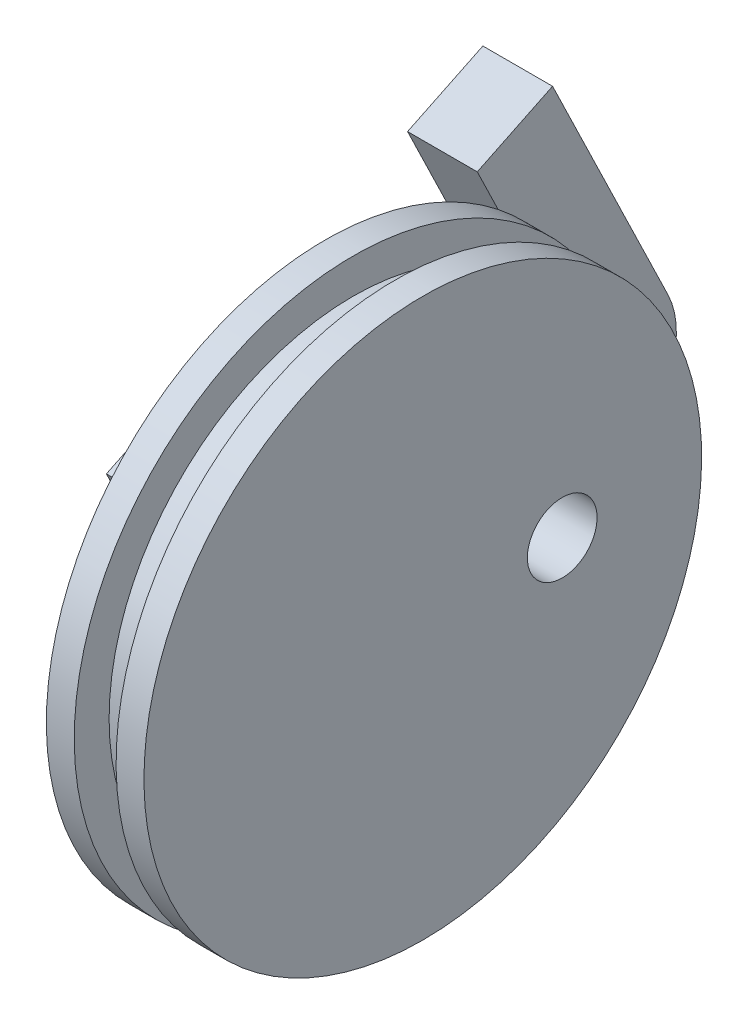
ISO-10303-21;
HEADER;
FILE_DESCRIPTION(('STEP AP214'),'2;1');
FILE_NAME('part.step','',(''),(''),'','','');
FILE_SCHEMA(('AUTOMOTIVE_DESIGN { 1 0 10303 214 1 1 1 1 }'));
ENDSEC;
DATA;
#1=APPLICATION_CONTEXT('core data for automotive mechanical design processes');
#2=APPLICATION_PROTOCOL_DEFINITION('international standard','automotive_design',2000,#1);
#3=PRODUCT_CONTEXT('',#1,'mechanical');
#4=PRODUCT('Part','Part','',(#3));
#5=PRODUCT_RELATED_PRODUCT_CATEGORY('part','',(#4));
#6=PRODUCT_DEFINITION_FORMATION('','',#4);
#7=PRODUCT_DEFINITION_CONTEXT('part definition',#1,'design');
#8=PRODUCT_DEFINITION('design','',#6,#7);
#9=PRODUCT_DEFINITION_SHAPE('','',#8);
#10=(LENGTH_UNIT() NAMED_UNIT(*) SI_UNIT(.MILLI.,.METRE.));
#11=(NAMED_UNIT(*) PLANE_ANGLE_UNIT() SI_UNIT($,.RADIAN.));
#12=(NAMED_UNIT(*) SI_UNIT($,.STERADIAN.) SOLID_ANGLE_UNIT());
#13=UNCERTAINTY_MEASURE_WITH_UNIT(LENGTH_MEASURE(1.E-05),#10,'distance_accuracy_value','');
#14=(GEOMETRIC_REPRESENTATION_CONTEXT(3) GLOBAL_UNCERTAINTY_ASSIGNED_CONTEXT((#13)) GLOBAL_UNIT_ASSIGNED_CONTEXT((#10,
#11,#12)) REPRESENTATION_CONTEXT('',''));
#15=CARTESIAN_POINT('',(0.,0.,0.));
#16=DIRECTION('',(0.,0.,1.));
#17=DIRECTION('',(1.,0.,0.));
#18=AXIS2_PLACEMENT_3D('',#15,#16,#17);
#19=CARTESIAN_POINT('',(-3.5,0.,0.));
#20=DIRECTION('',(-1.,0.,0.));
#21=DIRECTION('',(0.,-1.,0.));
#22=AXIS2_PLACEMENT_3D('',#19,#20,#21);
#23=CYLINDRICAL_SURFACE('',#22,20.);
#24=CARTESIAN_POINT('',(3.5,0.,0.));
#25=DIRECTION('',(-1.,0.,0.));
#26=DIRECTION('',(0.,-1.,0.));
#27=AXIS2_PLACEMENT_3D('',#24,#25,#26);
#28=CIRCLE('',#27,20.);
#29=CARTESIAN_POINT('',(3.50000000000001,-20.,0.));
#30=VERTEX_POINT('',#29);
#31=EDGE_CURVE('E162',#30,#30,#28,.T.);
#32=ORIENTED_EDGE('',*,*,#31,.T.);
#33=EDGE_LOOP('',(#32));
#34=FACE_BOUND('',#33,.T.);
#35=CARTESIAN_POINT('',(1.50000000000001,0.,0.));
#36=DIRECTION('',(-1.,0.,0.));
#37=DIRECTION('',(0.,-1.,0.));
#38=AXIS2_PLACEMENT_3D('',#35,#36,#37);
#39=CIRCLE('',#38,20.);
#40=CARTESIAN_POINT('',(1.50000000000001,-20.,0.));
#41=VERTEX_POINT('',#40);
#42=EDGE_CURVE('E49',#41,#41,#39,.T.);
#43=ORIENTED_EDGE('',*,*,#42,.F.);
#44=EDGE_LOOP('',(#43));
#45=FACE_BOUND('',#44,.T.);
#46=ADVANCED_FACE('F45',(#34,#45),#23,.T.);
#47=CARTESIAN_POINT('',(1.50000000000001,0.,0.));
#48=DIRECTION('',(1.,0.,0.));
#49=DIRECTION('',(0.,1.,0.));
#50=AXIS2_PLACEMENT_3D('',#47,#48,#49);
#51=PLANE('',#50);
#52=CARTESIAN_POINT('',(1.50000000000001,0.,0.));
#53=DIRECTION('',(-1.,0.,0.));
#54=DIRECTION('',(0.,-1.,0.));
#55=AXIS2_PLACEMENT_3D('',#52,#53,#54);
#56=CIRCLE('',#55,17.5);
#57=CARTESIAN_POINT('',(1.50000000000001,-17.5,0.));
#58=VERTEX_POINT('',#57);
#59=EDGE_CURVE('E184',#58,#58,#56,.T.);
#60=ORIENTED_EDGE('',*,*,#59,.F.);
#61=EDGE_LOOP('',(#60));
#62=FACE_BOUND('',#61,.T.);
#63=ORIENTED_EDGE('',*,*,#42,.T.);
#64=EDGE_LOOP('',(#63));
#65=FACE_BOUND('',#64,.T.);
#66=ADVANCED_FACE('F47',(#62,#65),#51,.F.);
#67=CARTESIAN_POINT('',(-3.5,0.,0.));
#68=DIRECTION('',(-1.,0.,0.));
#69=DIRECTION('',(0.,-1.,0.));
#70=AXIS2_PLACEMENT_3D('',#67,#68,#69);
#71=CYLINDRICAL_SURFACE('',#70,17.5);
#72=ORIENTED_EDGE('',*,*,#59,.T.);
#73=EDGE_LOOP('',(#72));
#74=FACE_BOUND('',#73,.T.);
#75=CARTESIAN_POINT('',(-1.49999999999999,0.,0.));
#76=DIRECTION('',(-1.,0.,0.));
#77=DIRECTION('',(0.,-1.,0.));
#78=AXIS2_PLACEMENT_3D('',#75,#76,#77);
#79=CIRCLE('',#78,17.5);
#80=CARTESIAN_POINT('',(-1.49999999999999,-17.5,0.));
#81=VERTEX_POINT('',#80);
#82=EDGE_CURVE('E181',#81,#81,#79,.T.);
#83=ORIENTED_EDGE('',*,*,#82,.F.);
#84=EDGE_LOOP('',(#83));
#85=FACE_BOUND('',#84,.T.);
#86=ADVANCED_FACE('F277',(#74,#85),#71,.T.);
#87=CARTESIAN_POINT('',(-1.49999999999999,0.,0.));
#88=DIRECTION('',(1.,0.,0.));
#89=DIRECTION('',(0.,1.,0.));
#90=AXIS2_PLACEMENT_3D('',#87,#88,#89);
#91=PLANE('',#90);
#92=ORIENTED_EDGE('',*,*,#82,.T.);
#93=EDGE_LOOP('',(#92));
#94=FACE_BOUND('',#93,.T.);
#95=CARTESIAN_POINT('',(-1.49999999999999,0.,0.));
#96=DIRECTION('',(-1.,0.,0.));
#97=DIRECTION('',(0.,-1.,0.));
#98=AXIS2_PLACEMENT_3D('',#95,#96,#97);
#99=CIRCLE('',#98,20.);
#100=CARTESIAN_POINT('',(-1.49999999999999,-20.,0.));
#101=VERTEX_POINT('',#100);
#102=EDGE_CURVE('E177',#101,#101,#99,.T.);
#103=ORIENTED_EDGE('',*,*,#102,.F.);
#104=EDGE_LOOP('',(#103));
#105=FACE_BOUND('',#104,.T.);
#106=ADVANCED_FACE('F284',(#94,#105),#91,.T.);
#107=ORIENTED_EDGE('',*,*,#102,.T.);
#108=EDGE_LOOP('',(#107));
#109=FACE_BOUND('',#108,.T.);
#110=CARTESIAN_POINT('',(-3.49999999999999,0.,0.));
#111=DIRECTION('',(-1.,0.,0.));
#112=DIRECTION('',(0.,-1.,0.));
#113=AXIS2_PLACEMENT_3D('',#110,#111,#112);
#114=CIRCLE('',#113,20.);
#115=CARTESIAN_POINT('',(-3.5,15.6920361967464,-12.4));
#116=VERTEX_POINT('',#115);
#117=CARTESIAN_POINT('',(-3.49999999999999,-4.89593960126535,-19.3914871895056));
#118=VERTEX_POINT('',#117);
#119=EDGE_CURVE('E173',#116,#118,#114,.T.);
#120=ORIENTED_EDGE('',*,*,#119,.F.);
#121=EDGE_CURVE('E167',#118,#116,#114,.T.);
#122=ORIENTED_EDGE('',*,*,#121,.F.);
#123=EDGE_LOOP('',(#120,#122));
#124=FACE_BOUND('',#123,.T.);
#125=ADVANCED_FACE('F273',(#109,#124),#23,.T.);
#126=CARTESIAN_POINT('',(-3.5,0.,0.));
#127=DIRECTION('',(-1.,0.,0.));
#128=DIRECTION('',(0.,-1.,0.));
#129=AXIS2_PLACEMENT_3D('',#126,#127,#128);
#130=PLANE('',#129);
#131=DIRECTION('',(0.,-0.435889894354067,0.900000000000001));
#132=VECTOR('',#131,1.);
#133=CARTESIAN_POINT('',(-3.5,-6.1730090491866,-2.98972473588516));
#134=LINE('',#133,#132);
#135=CARTESIAN_POINT('',(-3.5,1.6730090491866,-19.1897247358852));
#136=VERTEX_POINT('',#135);
#137=CARTESIAN_POINT('',(-3.5,-2.25,-11.0897247358852));
#138=VERTEX_POINT('',#137);
#139=EDGE_CURVE('E201',#136,#138,#134,.T.);
#140=ORIENTED_EDGE('',*,*,#139,.T.);
#141=CARTESIAN_POINT('',(-3.5,0.,-10.));
#142=DIRECTION('',(-1.,0.,0.));
#143=DIRECTION('',(0.,-1.,0.));
#144=AXIS2_PLACEMENT_3D('',#141,#142,#143);
#145=CIRCLE('',#144,2.5);
#146=EDGE_CURVE('E62',#138,#138,#145,.T.);
#147=ORIENTED_EDGE('',*,*,#146,.F.);
#148=CARTESIAN_POINT('',(-3.5,-6.1730090491866,-2.98972473588516));
#149=VERTEX_POINT('',#148);
#150=EDGE_CURVE('E208',#138,#149,#134,.T.);
#151=ORIENTED_EDGE('',*,*,#150,.T.);
#152=DIRECTION('',(0.,-0.9,-0.435889894354066));
#153=VECTOR('',#152,1.);
#154=CARTESIAN_POINT('',(-3.5,0.,0.));
#155=LINE('',#154,#153);
#156=CARTESIAN_POINT('',(-3.5,10.9269909508134,5.2921832568421));
#157=VERTEX_POINT('',#156);
#158=EDGE_CURVE('E211',#157,#149,#155,.T.);
#159=ORIENTED_EDGE('',*,*,#158,.F.);
#160=DIRECTION('',(0.,-0.435889894354067,0.9));
#161=VECTOR('',#160,1.);
#162=CARTESIAN_POINT('',(-3.5,10.9269909508134,5.2921832568421));
#163=LINE('',#162,#161);
#164=CARTESIAN_POINT('',(-3.5,8.311651584689,10.6921832568421));
#165=VERTEX_POINT('',#164);
#166=EDGE_CURVE('E216',#157,#165,#163,.T.);
#167=ORIENTED_EDGE('',*,*,#166,.T.);
#168=DIRECTION('',(0.,-0.9,-0.435889894354067));
#169=VECTOR('',#168,1.);
#170=CARTESIAN_POINT('',(-3.5,-2.6153393661244,5.4));
#171=LINE('',#170,#169);
#172=CARTESIAN_POINT('',(-3.49999999999999,-8.78834841531096,2.41027526411486));
#173=VERTEX_POINT('',#172);
#174=EDGE_CURVE('E219',#165,#173,#171,.T.);
#175=ORIENTED_EDGE('',*,*,#174,.T.);
#176=CARTESIAN_POINT('',(-3.5,-6.1730090491866,-2.98972473588516));
#177=DIRECTION('',(-1.,0.,0.));
#178=DIRECTION('',(0.,-1.,0.));
#179=AXIS2_PLACEMENT_3D('',#176,#177,#178);
#180=CIRCLE('',#179,6.);
#181=CARTESIAN_POINT('',(-3.49999999999999,-11.5730090491866,-5.6050641020096));
#182=VERTEX_POINT('',#181);
#183=EDGE_CURVE('E222',#182,#173,#180,.T.);
#184=ORIENTED_EDGE('',*,*,#183,.F.);
#185=DIRECTION('',(0.,-0.435889894354067,0.9));
#186=VECTOR('',#185,1.);
#187=CARTESIAN_POINT('',(-3.49999999999999,-11.5730090491866,-5.60506410200956));
#188=LINE('',#187,#186);
#189=EDGE_CURVE('E11',#118,#182,#188,.T.);
#190=ORIENTED_EDGE('',*,*,#189,.F.);
#191=ORIENTED_EDGE('',*,*,#121,.T.);
#192=DIRECTION('',(0.,-0.900000000000001,-0.435889894354066));
#193=VECTOR('',#192,1.);
#194=CARTESIAN_POINT('',(-3.5,7.8460180983732,-16.2));
#195=LINE('',#194,#193);
#196=EDGE_CURVE('E55',#116,#136,#195,.T.);
#197=ORIENTED_EDGE('',*,*,#196,.T.);
#198=EDGE_LOOP('',(#140,#147,#151,#159,#167,#175,#184,#190,#191,#197));
#199=FACE_BOUND('',#198,.T.);
#200=ADVANCED_FACE('F283',(#199),#130,.T.);
#201=CARTESIAN_POINT('',(3.5,0.,0.));
#202=DIRECTION('',(-1.,0.,0.));
#203=DIRECTION('',(0.,-1.,0.));
#204=AXIS2_PLACEMENT_3D('',#201,#202,#203);
#205=PLANE('',#204);
#206=CARTESIAN_POINT('',(3.50000000000001,0.,-10.));
#207=DIRECTION('',(-1.,0.,0.));
#208=DIRECTION('',(0.,-1.,0.));
#209=AXIS2_PLACEMENT_3D('',#206,#207,#208);
#210=CIRCLE('',#209,2.5);
#211=CARTESIAN_POINT('',(3.50000000000001,-2.5,-10.));
#212=VERTEX_POINT('',#211);
#213=EDGE_CURVE('E226',#212,#212,#210,.T.);
#214=ORIENTED_EDGE('',*,*,#213,.T.);
#215=EDGE_LOOP('',(#214));
#216=FACE_BOUND('',#215,.T.);
#217=ORIENTED_EDGE('',*,*,#31,.F.);
#218=EDGE_LOOP('',(#217));
#219=FACE_BOUND('',#218,.T.);
#220=ADVANCED_FACE('F259',(#216,#219),#205,.F.);
#221=CARTESIAN_POINT('',(-3.5,0.,0.));
#222=DIRECTION('',(-1.,0.,0.));
#223=DIRECTION('',(0.,-1.,0.));
#224=AXIS2_PLACEMENT_3D('',#221,#222,#223);
#225=PLANE('',#224);
#226=CARTESIAN_POINT('',(-3.5,18.7730090491866,-10.9078167431579));
#227=VERTEX_POINT('',#226);
#228=EDGE_CURVE('E195',#227,#116,#195,.T.);
#229=ORIENTED_EDGE('',*,*,#228,.T.);
#230=ORIENTED_EDGE('',*,*,#119,.T.);
#231=CARTESIAN_POINT('',(-3.5,-3.72699095081342,-21.8050641020095));
#232=VERTEX_POINT('',#231);
#233=EDGE_CURVE('E57',#232,#118,#188,.T.);
#234=ORIENTED_EDGE('',*,*,#233,.F.);
#235=CARTESIAN_POINT('',(-3.5,1.6730090491866,-19.1897247358852));
#236=DIRECTION('',(-1.,0.,0.));
#237=DIRECTION('',(0.,-1.,0.));
#238=AXIS2_PLACEMENT_3D('',#235,#236,#237);
#239=CIRCLE('',#238,6.);
#240=CARTESIAN_POINT('',(-3.5,4.28834841531104,-24.5897247358851));
#241=VERTEX_POINT('',#240);
#242=EDGE_CURVE('E157',#241,#232,#239,.T.);
#243=ORIENTED_EDGE('',*,*,#242,.F.);
#244=DIRECTION('',(0.,-0.9,-0.435889894354067));
#245=VECTOR('',#244,1.);
#246=CARTESIAN_POINT('',(-3.5,10.4613574644976,-21.6));
#247=LINE('',#246,#245);
#248=CARTESIAN_POINT('',(-3.5,21.388348415311,-16.3078167431579));
#249=VERTEX_POINT('',#248);
#250=EDGE_CURVE('E207',#249,#241,#247,.T.);
#251=ORIENTED_EDGE('',*,*,#250,.F.);
#252=DIRECTION('',(0.,0.435889894354067,-0.9));
#253=VECTOR('',#252,1.);
#254=CARTESIAN_POINT('',(-3.5,10.9269909508134,5.29218325684211));
#255=LINE('',#254,#253);
#256=EDGE_CURVE('E200',#227,#249,#255,.T.);
#257=ORIENTED_EDGE('',*,*,#256,.F.);
#258=EDGE_LOOP('',(#229,#230,#234,#243,#251,#257));
#259=FACE_BOUND('',#258,.T.);
#260=ADVANCED_FACE('F355',(#259),#225,.F.);
#261=CARTESIAN_POINT('',(-8.49999999999999,-11.5730090491866,-5.60506410200956));
#262=DIRECTION('',(0.,0.9,0.435889894354067));
#263=DIRECTION('',(0.,-0.435889894354067,0.9));
#264=AXIS2_PLACEMENT_3D('',#261,#262,#263);
#265=PLANE('',#264);
#266=ORIENTED_EDGE('',*,*,#233,.T.);
#267=ORIENTED_EDGE('',*,*,#189,.T.);
#268=DIRECTION('',(1.,0.,0.));
#269=VECTOR('',#268,1.);
#270=CARTESIAN_POINT('',(-8.49999999999999,-11.5730090491866,-5.6050641020096));
#271=LINE('',#270,#269);
#272=CARTESIAN_POINT('',(-8.49999999999999,-11.5730090491866,-5.6050641020096));
#273=VERTEX_POINT('',#272);
#274=EDGE_CURVE('E139',#273,#182,#271,.T.);
#275=ORIENTED_EDGE('',*,*,#274,.F.);
#276=DIRECTION('',(0.,-0.435889894354067,0.9));
#277=VECTOR('',#276,1.);
#278=CARTESIAN_POINT('',(-8.49999999999999,-11.5730090491866,-5.60506410200956));
#279=LINE('',#278,#277);
#280=CARTESIAN_POINT('',(-8.49999999999999,-3.72699095081342,-21.8050641020095));
#281=VERTEX_POINT('',#280);
#282=EDGE_CURVE('E147',#281,#273,#279,.T.);
#283=ORIENTED_EDGE('',*,*,#282,.F.);
#284=DIRECTION('',(1.,0.,0.));
#285=VECTOR('',#284,1.);
#286=CARTESIAN_POINT('',(-8.49999999999999,-3.72699095081342,-21.8050641020095));
#287=LINE('',#286,#285);
#288=EDGE_CURVE('E229',#281,#232,#287,.T.);
#289=ORIENTED_EDGE('',*,*,#288,.T.);
#290=EDGE_LOOP('',(#266,#267,#275,#283,#289));
#291=FACE_BOUND('',#290,.T.);
#292=ADVANCED_FACE('F160',(#291),#265,.F.);
#293=CARTESIAN_POINT('',(-8.49999999999999,-6.1730090491866,-2.98972473588516));
#294=DIRECTION('',(1.,0.,0.));
#295=DIRECTION('',(0.,1.,0.));
#296=AXIS2_PLACEMENT_3D('',#293,#294,#295);
#297=CYLINDRICAL_SURFACE('',#296,6.);
#298=ORIENTED_EDGE('',*,*,#183,.T.);
#299=DIRECTION('',(1.,0.,0.));
#300=VECTOR('',#299,1.);
#301=CARTESIAN_POINT('',(-8.49999999999999,-8.78834841531096,2.41027526411486));
#302=LINE('',#301,#300);
#303=CARTESIAN_POINT('',(-8.49999999999999,-8.78834841531096,2.41027526411486));
#304=VERTEX_POINT('',#303);
#305=EDGE_CURVE('E141',#304,#173,#302,.T.);
#306=ORIENTED_EDGE('',*,*,#305,.F.);
#307=CARTESIAN_POINT('',(-8.49999999999999,-6.1730090491866,-2.98972473588516));
#308=DIRECTION('',(-1.,0.,0.));
#309=DIRECTION('',(0.,-1.,0.));
#310=AXIS2_PLACEMENT_3D('',#307,#308,#309);
#311=CIRCLE('',#310,6.);
#312=EDGE_CURVE('E134',#273,#304,#311,.T.);
#313=ORIENTED_EDGE('',*,*,#312,.F.);
#314=ORIENTED_EDGE('',*,*,#274,.T.);
#315=EDGE_LOOP('',(#298,#306,#313,#314));
#316=FACE_BOUND('',#315,.T.);
#317=ADVANCED_FACE('F137',(#316),#297,.T.);
#318=CARTESIAN_POINT('',(-8.49999999999999,-2.6153393661244,5.4));
#319=DIRECTION('',(0.,-0.435889894354067,0.9));
#320=DIRECTION('',(0.,-0.9,-0.435889894354067));
#321=AXIS2_PLACEMENT_3D('',#318,#319,#320);
#322=PLANE('',#321);
#323=ORIENTED_EDGE('',*,*,#174,.F.);
#324=DIRECTION('',(1.,0.,0.));
#325=VECTOR('',#324,1.);
#326=CARTESIAN_POINT('',(-8.5,8.311651584689,10.6921832568421));
#327=LINE('',#326,#325);
#328=CARTESIAN_POINT('',(-8.5,8.311651584689,10.6921832568421));
#329=VERTEX_POINT('',#328);
#330=EDGE_CURVE('E169',#329,#165,#327,.T.);
#331=ORIENTED_EDGE('',*,*,#330,.F.);
#332=DIRECTION('',(0.,-0.9,-0.435889894354067));
#333=VECTOR('',#332,1.);
#334=CARTESIAN_POINT('',(-8.49999999999999,-2.6153393661244,5.4));
#335=LINE('',#334,#333);
#336=EDGE_CURVE('E146',#329,#304,#335,.T.);
#337=ORIENTED_EDGE('',*,*,#336,.T.);
#338=ORIENTED_EDGE('',*,*,#305,.T.);
#339=EDGE_LOOP('',(#323,#331,#337,#338));
#340=FACE_BOUND('',#339,.T.);
#341=ADVANCED_FACE('F327',(#340),#322,.T.);
#342=CARTESIAN_POINT('',(-8.5,10.9269909508134,5.2921832568421));
#343=DIRECTION('',(0.,0.9,0.435889894354067));
#344=DIRECTION('',(0.,-0.435889894354067,0.9));
#345=AXIS2_PLACEMENT_3D('',#342,#343,#344);
#346=PLANE('',#345);
#347=ORIENTED_EDGE('',*,*,#166,.F.);
#348=DIRECTION('',(1.,0.,0.));
#349=VECTOR('',#348,1.);
#350=CARTESIAN_POINT('',(-8.5,10.9269909508134,5.2921832568421));
#351=LINE('',#350,#349);
#352=CARTESIAN_POINT('',(-8.5,10.9269909508134,5.2921832568421));
#353=VERTEX_POINT('',#352);
#354=EDGE_CURVE('E317',#353,#157,#351,.T.);
#355=ORIENTED_EDGE('',*,*,#354,.F.);
#356=DIRECTION('',(0.,-0.435889894354067,0.9));
#357=VECTOR('',#356,1.);
#358=CARTESIAN_POINT('',(-8.5,10.9269909508134,5.2921832568421));
#359=LINE('',#358,#357);
#360=EDGE_CURVE('E247',#353,#329,#359,.T.);
#361=ORIENTED_EDGE('',*,*,#360,.T.);
#362=ORIENTED_EDGE('',*,*,#330,.T.);
#363=EDGE_LOOP('',(#347,#355,#361,#362));
#364=FACE_BOUND('',#363,.T.);
#365=ADVANCED_FACE('F323',(#364),#346,.T.);
#366=CARTESIAN_POINT('',(-8.5,0.,0.));
#367=DIRECTION('',(0.,-0.435889894354066,0.9));
#368=DIRECTION('',(0.,-0.9,-0.435889894354066));
#369=AXIS2_PLACEMENT_3D('',#366,#367,#368);
#370=PLANE('',#369);
#371=ORIENTED_EDGE('',*,*,#158,.T.);
#372=DIRECTION('',(1.,0.,0.));
#373=VECTOR('',#372,1.);
#374=CARTESIAN_POINT('',(-8.49999999999999,-6.1730090491866,-2.98972473588516));
#375=LINE('',#374,#373);
#376=CARTESIAN_POINT('',(-8.49999999999999,-6.1730090491866,-2.98972473588516));
#377=VERTEX_POINT('',#376);
#378=EDGE_CURVE('E305',#377,#149,#375,.T.);
#379=ORIENTED_EDGE('',*,*,#378,.F.);
#380=DIRECTION('',(0.,-0.9,-0.435889894354066));
#381=VECTOR('',#380,1.);
#382=CARTESIAN_POINT('',(-8.5,0.,0.));
#383=LINE('',#382,#381);
#384=EDGE_CURVE('E244',#353,#377,#383,.T.);
#385=ORIENTED_EDGE('',*,*,#384,.F.);
#386=ORIENTED_EDGE('',*,*,#354,.T.);
#387=EDGE_LOOP('',(#371,#379,#385,#386));
#388=FACE_BOUND('',#387,.T.);
#389=ADVANCED_FACE('F318',(#388),#370,.F.);
#390=CARTESIAN_POINT('',(-8.49999999999999,-6.1730090491866,-2.98972473588516));
#391=DIRECTION('',(0.,0.9,0.435889894354066));
#392=DIRECTION('',(0.,-0.435889894354066,0.9));
#393=AXIS2_PLACEMENT_3D('',#390,#391,#392);
#394=PLANE('',#393);
#395=ORIENTED_EDGE('',*,*,#139,.F.);
#396=DIRECTION('',(1.,0.,0.));
#397=VECTOR('',#396,1.);
#398=CARTESIAN_POINT('',(-8.5,1.67300904918659,-19.1897247358852));
#399=LINE('',#398,#397);
#400=CARTESIAN_POINT('',(-8.5,1.67300904918659,-19.1897247358852));
#401=VERTEX_POINT('',#400);
#402=EDGE_CURVE('E300',#401,#136,#399,.T.);
#403=ORIENTED_EDGE('',*,*,#402,.F.);
#404=DIRECTION('',(0.,-0.435889894354067,0.900000000000001));
#405=VECTOR('',#404,1.);
#406=CARTESIAN_POINT('',(-8.49999999999999,-6.1730090491866,-2.98972473588516));
#407=LINE('',#406,#405);
#408=EDGE_CURVE('E240',#401,#377,#407,.T.);
#409=ORIENTED_EDGE('',*,*,#408,.T.);
#410=ORIENTED_EDGE('',*,*,#378,.T.);
#411=ORIENTED_EDGE('',*,*,#150,.F.);
#412=EDGE_LOOP('',(#395,#403,#409,#410,#411));
#413=FACE_BOUND('',#412,.T.);
#414=ADVANCED_FACE('F309',(#413),#394,.T.);
#415=CARTESIAN_POINT('',(-8.5,7.8460180983732,-16.2));
#416=DIRECTION('',(0.,-0.435889894354066,0.9));
#417=DIRECTION('',(0.,-0.9,-0.435889894354066));
#418=AXIS2_PLACEMENT_3D('',#415,#416,#417);
#419=PLANE('',#418);
#420=ORIENTED_EDGE('',*,*,#228,.F.);
#421=DIRECTION('',(1.,0.,0.));
#422=VECTOR('',#421,1.);
#423=CARTESIAN_POINT('',(-8.5,18.7730090491866,-10.9078167431579));
#424=LINE('',#423,#422);
#425=CARTESIAN_POINT('',(-8.5,18.7730090491866,-10.9078167431579));
#426=VERTEX_POINT('',#425);
#427=EDGE_CURVE('E306',#426,#227,#424,.T.);
#428=ORIENTED_EDGE('',*,*,#427,.F.);
#429=DIRECTION('',(0.,-0.900000000000001,-0.435889894354066));
#430=VECTOR('',#429,1.);
#431=CARTESIAN_POINT('',(-8.5,7.8460180983732,-16.2));
#432=LINE('',#431,#430);
#433=EDGE_CURVE('E236',#426,#401,#432,.T.);
#434=ORIENTED_EDGE('',*,*,#433,.T.);
#435=ORIENTED_EDGE('',*,*,#402,.T.);
#436=ORIENTED_EDGE('',*,*,#196,.F.);
#437=EDGE_LOOP('',(#420,#428,#434,#435,#436));
#438=FACE_BOUND('',#437,.T.);
#439=ADVANCED_FACE('F299',(#438),#419,.T.);
#440=CARTESIAN_POINT('',(-8.5,10.9269909508134,5.29218325684211));
#441=DIRECTION('',(0.,-0.9,-0.435889894354067));
#442=DIRECTION('',(0.,0.435889894354067,-0.9));
#443=AXIS2_PLACEMENT_3D('',#440,#441,#442);
#444=PLANE('',#443);
#445=ORIENTED_EDGE('',*,*,#256,.T.);
#446=DIRECTION('',(1.,0.,0.));
#447=VECTOR('',#446,1.);
#448=CARTESIAN_POINT('',(-8.5,21.388348415311,-16.3078167431579));
#449=LINE('',#448,#447);
#450=CARTESIAN_POINT('',(-8.5,21.388348415311,-16.3078167431579));
#451=VERTEX_POINT('',#450);
#452=EDGE_CURVE('E334',#451,#249,#449,.T.);
#453=ORIENTED_EDGE('',*,*,#452,.F.);
#454=DIRECTION('',(0.,0.435889894354067,-0.9));
#455=VECTOR('',#454,1.);
#456=CARTESIAN_POINT('',(-8.5,10.9269909508134,5.29218325684211));
#457=LINE('',#456,#455);
#458=EDGE_CURVE('E233',#426,#451,#457,.T.);
#459=ORIENTED_EDGE('',*,*,#458,.F.);
#460=ORIENTED_EDGE('',*,*,#427,.T.);
#461=EDGE_LOOP('',(#445,#453,#459,#460));
#462=FACE_BOUND('',#461,.T.);
#463=ADVANCED_FACE('F369',(#462),#444,.F.);
#464=CARTESIAN_POINT('',(-8.5,10.4613574644976,-21.6));
#465=DIRECTION('',(0.,-0.435889894354067,0.9));
#466=DIRECTION('',(0.,-0.9,-0.435889894354067));
#467=AXIS2_PLACEMENT_3D('',#464,#465,#466);
#468=PLANE('',#467);
#469=ORIENTED_EDGE('',*,*,#250,.T.);
#470=DIRECTION('',(1.,0.,0.));
#471=VECTOR('',#470,1.);
#472=CARTESIAN_POINT('',(-8.5,4.28834841531104,-24.5897247358851));
#473=LINE('',#472,#471);
#474=CARTESIAN_POINT('',(-8.5,4.28834841531104,-24.5897247358851));
#475=VERTEX_POINT('',#474);
#476=EDGE_CURVE('E338',#475,#241,#473,.T.);
#477=ORIENTED_EDGE('',*,*,#476,.F.);
#478=DIRECTION('',(0.,-0.9,-0.435889894354067));
#479=VECTOR('',#478,1.);
#480=CARTESIAN_POINT('',(-8.5,10.4613574644976,-21.6));
#481=LINE('',#480,#479);
#482=EDGE_CURVE('E230',#451,#475,#481,.T.);
#483=ORIENTED_EDGE('',*,*,#482,.F.);
#484=ORIENTED_EDGE('',*,*,#452,.T.);
#485=EDGE_LOOP('',(#469,#477,#483,#484));
#486=FACE_BOUND('',#485,.T.);
#487=ADVANCED_FACE('F350',(#486),#468,.F.);
#488=CARTESIAN_POINT('',(-8.5,1.6730090491866,-19.1897247358852));
#489=DIRECTION('',(1.,0.,0.));
#490=DIRECTION('',(0.,1.,0.));
#491=AXIS2_PLACEMENT_3D('',#488,#489,#490);
#492=CYLINDRICAL_SURFACE('',#491,6.);
#493=ORIENTED_EDGE('',*,*,#242,.T.);
#494=ORIENTED_EDGE('',*,*,#288,.F.);
#495=CARTESIAN_POINT('',(-8.5,1.6730090491866,-19.1897247358852));
#496=DIRECTION('',(-1.,0.,0.));
#497=DIRECTION('',(0.,-1.,0.));
#498=AXIS2_PLACEMENT_3D('',#495,#496,#497);
#499=CIRCLE('',#498,6.);
#500=EDGE_CURVE('E152',#475,#281,#499,.T.);
#501=ORIENTED_EDGE('',*,*,#500,.F.);
#502=ORIENTED_EDGE('',*,*,#476,.T.);
#503=EDGE_LOOP('',(#493,#494,#501,#502));
#504=FACE_BOUND('',#503,.T.);
#505=ADVANCED_FACE('F268',(#504),#492,.T.);
#506=CARTESIAN_POINT('',(-8.5,0.,0.));
#507=DIRECTION('',(-1.,0.,0.));
#508=DIRECTION('',(0.,-1.,0.));
#509=AXIS2_PLACEMENT_3D('',#506,#507,#508);
#510=PLANE('',#509);
#511=ORIENTED_EDGE('',*,*,#282,.T.);
#512=ORIENTED_EDGE('',*,*,#312,.T.);
#513=ORIENTED_EDGE('',*,*,#336,.F.);
#514=ORIENTED_EDGE('',*,*,#360,.F.);
#515=ORIENTED_EDGE('',*,*,#384,.T.);
#516=ORIENTED_EDGE('',*,*,#408,.F.);
#517=ORIENTED_EDGE('',*,*,#433,.F.);
#518=ORIENTED_EDGE('',*,*,#458,.T.);
#519=ORIENTED_EDGE('',*,*,#482,.T.);
#520=ORIENTED_EDGE('',*,*,#500,.T.);
#521=EDGE_LOOP('',(#511,#512,#513,#514,#515,#516,#517,#518,#519,#520));
#522=FACE_BOUND('',#521,.T.);
#523=ADVANCED_FACE('F150',(#522),#510,.T.);
#524=CARTESIAN_POINT('',(3.50000000000001,0.,-10.));
#525=DIRECTION('',(-1.,0.,0.));
#526=DIRECTION('',(0.,-1.,0.));
#527=AXIS2_PLACEMENT_3D('',#524,#525,#526);
#528=CYLINDRICAL_SURFACE('',#527,2.5);
#529=ORIENTED_EDGE('',*,*,#213,.F.);
#530=EDGE_LOOP('',(#529));
#531=FACE_BOUND('',#530,.T.);
#532=ORIENTED_EDGE('',*,*,#146,.T.);
#533=EDGE_LOOP('',(#532));
#534=FACE_BOUND('',#533,.T.);
#535=ADVANCED_FACE('F262',(#531,#534),#528,.F.);
#536=CLOSED_SHELL('',(#46,#66,#86,#106,#125,#200,#220,#260,#292,#317,#341,#365,#389,#414,#439,
#463,#487,#505,#523,#535));
#537=MANIFOLD_SOLID_BREP('B2',#536);
#538=ADVANCED_BREP_SHAPE_REPRESENTATION('',(#18,#537),#14);
#539=SHAPE_DEFINITION_REPRESENTATION(#9,#538);
ENDSEC;
END-ISO-10303-21;
